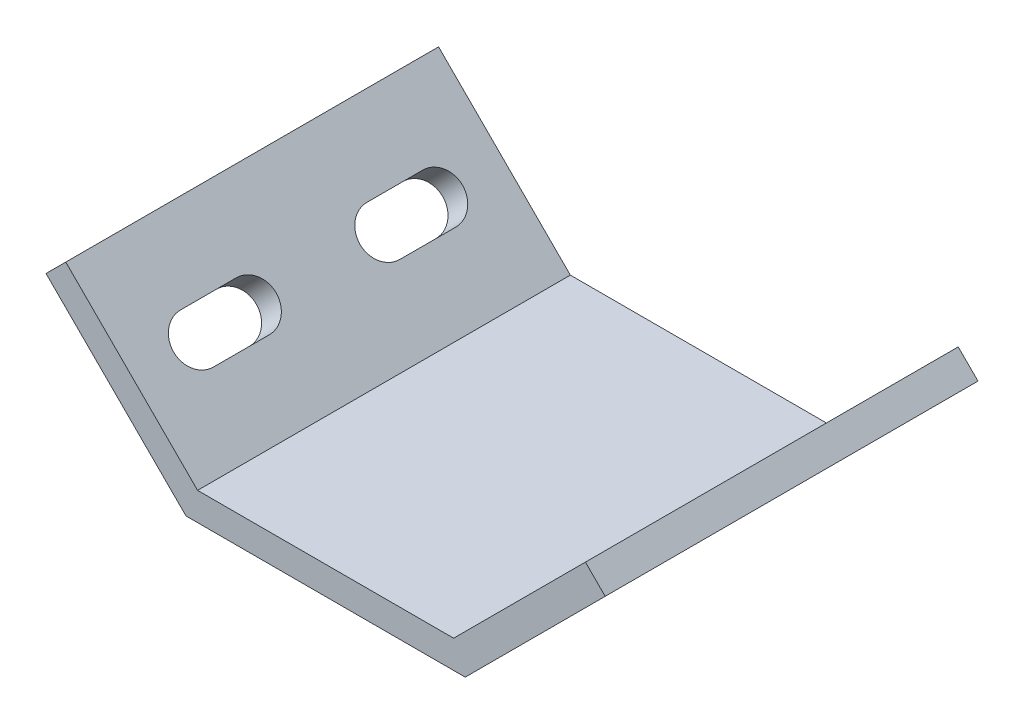
ISO-10303-21;
HEADER;
FILE_DESCRIPTION(('STEP AP214'),'2;1');
FILE_NAME('part.step','',(''),(''),'','','');
FILE_SCHEMA(('AUTOMOTIVE_DESIGN { 1 0 10303 214 1 1 1 1 }'));
ENDSEC;
DATA;
#1=APPLICATION_CONTEXT('core data for automotive mechanical design processes');
#2=APPLICATION_PROTOCOL_DEFINITION('international standard','automotive_design',2000,#1);
#3=PRODUCT_CONTEXT('',#1,'mechanical');
#4=PRODUCT('Part','Part','',(#3));
#5=PRODUCT_RELATED_PRODUCT_CATEGORY('part','',(#4));
#6=PRODUCT_DEFINITION_FORMATION('','',#4);
#7=PRODUCT_DEFINITION_CONTEXT('part definition',#1,'design');
#8=PRODUCT_DEFINITION('design','',#6,#7);
#9=PRODUCT_DEFINITION_SHAPE('','',#8);
#10=(LENGTH_UNIT() NAMED_UNIT(*) SI_UNIT(.MILLI.,.METRE.));
#11=(NAMED_UNIT(*) PLANE_ANGLE_UNIT() SI_UNIT($,.RADIAN.));
#12=(NAMED_UNIT(*) SI_UNIT($,.STERADIAN.) SOLID_ANGLE_UNIT());
#13=UNCERTAINTY_MEASURE_WITH_UNIT(LENGTH_MEASURE(1.E-05),#10,'distance_accuracy_value','');
#14=(GEOMETRIC_REPRESENTATION_CONTEXT(3) GLOBAL_UNCERTAINTY_ASSIGNED_CONTEXT((#13)) GLOBAL_UNIT_ASSIGNED_CONTEXT((#10,
#11,#12)) REPRESENTATION_CONTEXT('',''));
#15=CARTESIAN_POINT('',(0.,0.,0.));
#16=DIRECTION('',(0.,0.,1.));
#17=DIRECTION('',(1.,0.,0.));
#18=AXIS2_PLACEMENT_3D('',#15,#16,#17);
#19=CARTESIAN_POINT('',(15.8578643762691,-2.12132034355965,20.));
#20=DIRECTION('',(-0.707106781186546,0.707106781186549,0.));
#21=DIRECTION('',(-0.707106781186549,-0.707106781186546,0.));
#22=AXIS2_PLACEMENT_3D('',#19,#20,#21);
#23=PLANE('',#22);
#24=DIRECTION('',(0.,0.,-1.));
#25=VECTOR('',#24,1.);
#26=CARTESIAN_POINT('',(14.9791847198287,-3.,20.));
#27=LINE('',#26,#25);
#28=CARTESIAN_POINT('',(14.9791847198287,-3.,20.));
#29=VERTEX_POINT('',#28);
#30=CARTESIAN_POINT('',(14.9791847198287,-3.,-20.));
#31=VERTEX_POINT('',#30);
#32=EDGE_CURVE('E434',#29,#31,#27,.T.);
#33=ORIENTED_EDGE('',*,*,#32,.T.);
#34=DIRECTION('',(0.707106781186549,0.707106781186546,0.));
#35=VECTOR('',#34,1.);
#36=CARTESIAN_POINT('',(15.8578643762691,-2.12132034355965,-20.));
#37=LINE('',#36,#35);
#38=CARTESIAN_POINT('',(30.,12.0208152801712,-20.));
#39=VERTEX_POINT('',#38);
#40=EDGE_CURVE('E284',#31,#39,#37,.T.);
#41=ORIENTED_EDGE('',*,*,#40,.T.);
#42=DIRECTION('',(0.,0.,-1.));
#43=VECTOR('',#42,1.);
#44=CARTESIAN_POINT('',(30.,12.0208152801712,20.));
#45=LINE('',#44,#43);
#46=CARTESIAN_POINT('',(30.,12.0208152801712,20.));
#47=VERTEX_POINT('',#46);
#48=EDGE_CURVE('E454',#47,#39,#45,.T.);
#49=ORIENTED_EDGE('',*,*,#48,.F.);
#50=DIRECTION('',(0.707106781186549,0.707106781186546,0.));
#51=VECTOR('',#50,1.);
#52=CARTESIAN_POINT('',(15.8578643762691,-2.12132034355965,20.));
#53=LINE('',#52,#51);
#54=EDGE_CURVE('E396',#29,#47,#53,.T.);
#55=ORIENTED_EDGE('',*,*,#54,.F.);
#56=EDGE_LOOP('',(#33,#41,#49,#55));
#57=FACE_BOUND('',#56,.T.);
#58=CARTESIAN_POINT('',(22.9289321881345,4.94974746830579,7.));
#59=DIRECTION('',(-0.707106781186546,0.707106781186549,0.));
#60=DIRECTION('',(-0.707106781186549,-0.707106781186546,0.));
#61=AXIS2_PLACEMENT_3D('',#58,#59,#60);
#62=CIRCLE('',#61,2.5);
#63=CARTESIAN_POINT('',(21.1611652351682,3.18198051533942,7.));
#64=VERTEX_POINT('',#63);
#65=CARTESIAN_POINT('',(24.6966991411009,6.71751442127216,7.));
#66=VERTEX_POINT('',#65);
#67=EDGE_CURVE('E374',#64,#66,#62,.F.);
#68=ORIENTED_EDGE('',*,*,#67,.F.);
#69=DIRECTION('',(0.,0.,-1.));
#70=VECTOR('',#69,1.);
#71=CARTESIAN_POINT('',(21.1611652351682,3.18198051533942,20.));
#72=LINE('',#71,#70);
#73=CARTESIAN_POINT('',(21.1611652351682,3.18198051533942,13.));
#74=VERTEX_POINT('',#73);
#75=EDGE_CURVE('E358',#74,#64,#72,.T.);
#76=ORIENTED_EDGE('',*,*,#75,.F.);
#77=CARTESIAN_POINT('',(22.9289321881345,4.94974746830579,13.));
#78=DIRECTION('',(-0.707106781186546,0.707106781186549,0.));
#79=DIRECTION('',(-0.707106781186549,-0.707106781186546,0.));
#80=AXIS2_PLACEMENT_3D('',#77,#78,#79);
#81=CIRCLE('',#80,2.5);
#82=CARTESIAN_POINT('',(24.6966991411009,6.71751442127216,13.));
#83=VERTEX_POINT('',#82);
#84=EDGE_CURVE('E368',#83,#74,#81,.F.);
#85=ORIENTED_EDGE('',*,*,#84,.F.);
#86=DIRECTION('',(0.,0.,1.));
#87=VECTOR('',#86,1.);
#88=CARTESIAN_POINT('',(24.6966991411009,6.71751442127216,20.));
#89=LINE('',#88,#87);
#90=EDGE_CURVE('E371',#66,#83,#89,.T.);
#91=ORIENTED_EDGE('',*,*,#90,.F.);
#92=EDGE_LOOP('',(#68,#76,#85,#91));
#93=FACE_BOUND('',#92,.T.);
#94=CARTESIAN_POINT('',(22.9289321881345,4.94974746830579,-7.));
#95=DIRECTION('',(0.707106781186546,-0.707106781186549,0.));
#96=DIRECTION('',(-0.707106781186549,-0.707106781186546,0.));
#97=AXIS2_PLACEMENT_3D('',#94,#95,#96);
#98=CIRCLE('',#97,2.5);
#99=CARTESIAN_POINT('',(21.1611652351682,3.18198051533942,-7.));
#100=VERTEX_POINT('',#99);
#101=CARTESIAN_POINT('',(24.6966991411009,6.71751442127216,-7.));
#102=VERTEX_POINT('',#101);
#103=EDGE_CURVE('E260',#100,#102,#98,.F.);
#104=ORIENTED_EDGE('',*,*,#103,.T.);
#105=DIRECTION('',(0.,0.,-1.));
#106=VECTOR('',#105,1.);
#107=CARTESIAN_POINT('',(24.6966991411009,6.71751442127216,-20.));
#108=LINE('',#107,#106);
#109=CARTESIAN_POINT('',(24.6966991411009,6.71751442127216,-13.));
#110=VERTEX_POINT('',#109);
#111=EDGE_CURVE('E256',#102,#110,#108,.T.);
#112=ORIENTED_EDGE('',*,*,#111,.T.);
#113=CARTESIAN_POINT('',(22.9289321881345,4.94974746830579,-13.));
#114=DIRECTION('',(0.707106781186546,-0.707106781186549,0.));
#115=DIRECTION('',(-0.707106781186549,-0.707106781186546,0.));
#116=AXIS2_PLACEMENT_3D('',#113,#114,#115);
#117=CIRCLE('',#116,2.5);
#118=CARTESIAN_POINT('',(21.1611652351682,3.18198051533942,-13.));
#119=VERTEX_POINT('',#118);
#120=EDGE_CURVE('E253',#110,#119,#117,.F.);
#121=ORIENTED_EDGE('',*,*,#120,.T.);
#122=DIRECTION('',(0.,0.,1.));
#123=VECTOR('',#122,1.);
#124=CARTESIAN_POINT('',(21.1611652351682,3.18198051533942,-20.));
#125=LINE('',#124,#123);
#126=EDGE_CURVE('E214',#119,#100,#125,.T.);
#127=ORIENTED_EDGE('',*,*,#126,.T.);
#128=EDGE_LOOP('',(#104,#112,#121,#127));
#129=FACE_BOUND('',#128,.T.);
#130=ADVANCED_FACE('F46',(#57,#93,#129),#23,.F.);
#131=CARTESIAN_POINT('',(13.7365440327094,0.,20.));
#132=DIRECTION('',(-0.707106781186546,0.707106781186549,0.));
#133=DIRECTION('',(-0.707106781186549,-0.707106781186546,0.));
#134=AXIS2_PLACEMENT_3D('',#131,#132,#133);
#135=PLANE('',#134);
#136=DIRECTION('',(0.,0.,-1.));
#137=VECTOR('',#136,1.);
#138=CARTESIAN_POINT('',(27.8786796564404,14.1421356237309,20.));
#139=LINE('',#138,#137);
#140=CARTESIAN_POINT('',(27.8786796564404,14.1421356237309,20.));
#141=VERTEX_POINT('',#140);
#142=CARTESIAN_POINT('',(27.8786796564404,14.1421356237309,-20.));
#143=VERTEX_POINT('',#142);
#144=EDGE_CURVE('E452',#141,#143,#139,.T.);
#145=ORIENTED_EDGE('',*,*,#144,.T.);
#146=DIRECTION('',(0.707106781186549,0.707106781186546,0.));
#147=VECTOR('',#146,1.);
#148=CARTESIAN_POINT('',(13.7365440327094,0.,-20.));
#149=LINE('',#148,#147);
#150=CARTESIAN_POINT('',(13.7365440327094,0.,-20.));
#151=VERTEX_POINT('',#150);
#152=EDGE_CURVE('E300',#151,#143,#149,.T.);
#153=ORIENTED_EDGE('',*,*,#152,.F.);
#154=DIRECTION('',(0.,0.,-1.));
#155=VECTOR('',#154,1.);
#156=CARTESIAN_POINT('',(13.7365440327094,0.,20.));
#157=LINE('',#156,#155);
#158=CARTESIAN_POINT('',(13.7365440327094,0.,20.));
#159=VERTEX_POINT('',#158);
#160=EDGE_CURVE('E449',#159,#151,#157,.T.);
#161=ORIENTED_EDGE('',*,*,#160,.F.);
#162=DIRECTION('',(0.707106781186549,0.707106781186546,0.));
#163=VECTOR('',#162,1.);
#164=CARTESIAN_POINT('',(13.7365440327094,0.,20.));
#165=LINE('',#164,#163);
#166=EDGE_CURVE('E412',#159,#141,#165,.T.);
#167=ORIENTED_EDGE('',*,*,#166,.T.);
#168=EDGE_LOOP('',(#145,#153,#161,#167));
#169=FACE_BOUND('',#168,.T.);
#170=DIRECTION('',(0.,0.,-1.));
#171=VECTOR('',#170,1.);
#172=CARTESIAN_POINT('',(19.0398448916085,5.30330085889907,7.));
#173=LINE('',#172,#171);
#174=CARTESIAN_POINT('',(19.0398448916085,5.30330085889907,13.));
#175=VERTEX_POINT('',#174);
#176=CARTESIAN_POINT('',(19.0398448916085,5.30330085889906,7.));
#177=VERTEX_POINT('',#176);
#178=EDGE_CURVE('E342',#175,#177,#173,.T.);
#179=ORIENTED_EDGE('',*,*,#178,.T.);
#180=CARTESIAN_POINT('',(20.8076118445749,7.07106781186544,7.));
#181=DIRECTION('',(0.707106781186546,-0.707106781186549,0.));
#182=DIRECTION('',(0.707106781186549,0.707106781186546,0.));
#183=AXIS2_PLACEMENT_3D('',#180,#181,#182);
#184=CIRCLE('',#183,2.5);
#185=CARTESIAN_POINT('',(22.5753787975413,8.8388347648318,7.));
#186=VERTEX_POINT('',#185);
#187=EDGE_CURVE('E69',#177,#186,#184,.T.);
#188=ORIENTED_EDGE('',*,*,#187,.T.);
#189=DIRECTION('',(0.,0.,1.));
#190=VECTOR('',#189,1.);
#191=CARTESIAN_POINT('',(22.5753787975413,8.8388347648318,7.));
#192=LINE('',#191,#190);
#193=CARTESIAN_POINT('',(22.5753787975413,8.83883476483181,13.));
#194=VERTEX_POINT('',#193);
#195=EDGE_CURVE('E350',#186,#194,#192,.T.);
#196=ORIENTED_EDGE('',*,*,#195,.T.);
#197=CARTESIAN_POINT('',(20.8076118445749,7.07106781186544,13.));
#198=DIRECTION('',(0.707106781186546,-0.707106781186549,0.));
#199=DIRECTION('',(0.707106781186549,0.707106781186546,0.));
#200=AXIS2_PLACEMENT_3D('',#197,#198,#199);
#201=CIRCLE('',#200,2.5);
#202=EDGE_CURVE('E346',#194,#175,#201,.T.);
#203=ORIENTED_EDGE('',*,*,#202,.T.);
#204=EDGE_LOOP('',(#179,#188,#196,#203));
#205=FACE_BOUND('',#204,.T.);
#206=DIRECTION('',(0.,0.,1.));
#207=VECTOR('',#206,1.);
#208=CARTESIAN_POINT('',(19.0398448916085,5.30330085889907,-7.));
#209=LINE('',#208,#207);
#210=CARTESIAN_POINT('',(19.0398448916085,5.30330085889907,-13.));
#211=VERTEX_POINT('',#210);
#212=CARTESIAN_POINT('',(19.0398448916085,5.30330085889906,-7.));
#213=VERTEX_POINT('',#212);
#214=EDGE_CURVE('E212',#211,#213,#209,.T.);
#215=ORIENTED_EDGE('',*,*,#214,.F.);
#216=CARTESIAN_POINT('',(20.8076118445749,7.07106781186544,-13.));
#217=DIRECTION('',(-0.707106781186546,0.707106781186549,0.));
#218=DIRECTION('',(0.707106781186549,0.707106781186546,0.));
#219=AXIS2_PLACEMENT_3D('',#216,#217,#218);
#220=CIRCLE('',#219,2.5);
#221=CARTESIAN_POINT('',(22.5753787975413,8.83883476483181,-13.));
#222=VERTEX_POINT('',#221);
#223=EDGE_CURVE('E223',#222,#211,#220,.T.);
#224=ORIENTED_EDGE('',*,*,#223,.F.);
#225=DIRECTION('',(0.,0.,-1.));
#226=VECTOR('',#225,1.);
#227=CARTESIAN_POINT('',(22.5753787975413,8.8388347648318,-7.));
#228=LINE('',#227,#226);
#229=CARTESIAN_POINT('',(22.5753787975413,8.8388347648318,-7.));
#230=VERTEX_POINT('',#229);
#231=EDGE_CURVE('E229',#230,#222,#228,.T.);
#232=ORIENTED_EDGE('',*,*,#231,.F.);
#233=CARTESIAN_POINT('',(20.8076118445749,7.07106781186544,-7.));
#234=DIRECTION('',(-0.707106781186546,0.707106781186549,0.));
#235=DIRECTION('',(0.707106781186549,0.707106781186546,0.));
#236=AXIS2_PLACEMENT_3D('',#233,#234,#235);
#237=CIRCLE('',#236,2.5);
#238=EDGE_CURVE('E234',#213,#230,#237,.T.);
#239=ORIENTED_EDGE('',*,*,#238,.F.);
#240=EDGE_LOOP('',(#215,#224,#232,#239));
#241=FACE_BOUND('',#240,.T.);
#242=ADVANCED_FACE('F232',(#169,#205,#241),#135,.T.);
#243=CARTESIAN_POINT('',(27.8786796564404,14.1421356237309,20.));
#244=DIRECTION('',(0.707106781186549,0.707106781186546,0.));
#245=DIRECTION('',(-0.707106781186546,0.707106781186549,0.));
#246=AXIS2_PLACEMENT_3D('',#243,#244,#245);
#247=PLANE('',#246);
#248=ORIENTED_EDGE('',*,*,#48,.T.);
#249=DIRECTION('',(0.707106781186546,-0.707106781186549,0.));
#250=VECTOR('',#249,1.);
#251=CARTESIAN_POINT('',(27.8786796564404,14.1421356237309,-20.));
#252=LINE('',#251,#250);
#253=EDGE_CURVE('E296',#143,#39,#252,.T.);
#254=ORIENTED_EDGE('',*,*,#253,.F.);
#255=ORIENTED_EDGE('',*,*,#144,.F.);
#256=DIRECTION('',(0.707106781186546,-0.707106781186549,0.));
#257=VECTOR('',#256,1.);
#258=CARTESIAN_POINT('',(27.8786796564404,14.1421356237309,20.));
#259=LINE('',#258,#257);
#260=EDGE_CURVE('E408',#141,#47,#259,.T.);
#261=ORIENTED_EDGE('',*,*,#260,.T.);
#262=EDGE_LOOP('',(#248,#254,#255,#261));
#263=FACE_BOUND('',#262,.T.);
#264=ADVANCED_FACE('F505',(#263),#247,.T.);
#265=CARTESIAN_POINT('',(-13.7365440327094,0.,20.));
#266=DIRECTION('',(0.,1.,0.));
#267=DIRECTION('',(-1.,0.,0.));
#268=AXIS2_PLACEMENT_3D('',#265,#266,#267);
#269=PLANE('',#268);
#270=ORIENTED_EDGE('',*,*,#160,.T.);
#271=DIRECTION('',(1.,0.,0.));
#272=VECTOR('',#271,1.);
#273=CARTESIAN_POINT('',(-13.7365440327094,0.,-20.));
#274=LINE('',#273,#272);
#275=CARTESIAN_POINT('',(-13.7365440327094,0.,-20.));
#276=VERTEX_POINT('',#275);
#277=EDGE_CURVE('E304',#276,#151,#274,.T.);
#278=ORIENTED_EDGE('',*,*,#277,.F.);
#279=DIRECTION('',(0.,0.,-1.));
#280=VECTOR('',#279,1.);
#281=CARTESIAN_POINT('',(-13.7365440327094,0.,20.));
#282=LINE('',#281,#280);
#283=CARTESIAN_POINT('',(-13.7365440327094,0.,20.));
#284=VERTEX_POINT('',#283);
#285=EDGE_CURVE('E446',#284,#276,#282,.T.);
#286=ORIENTED_EDGE('',*,*,#285,.F.);
#287=DIRECTION('',(1.,0.,0.));
#288=VECTOR('',#287,1.);
#289=CARTESIAN_POINT('',(-13.7365440327094,0.,20.));
#290=LINE('',#289,#288);
#291=EDGE_CURVE('E416',#284,#159,#290,.T.);
#292=ORIENTED_EDGE('',*,*,#291,.T.);
#293=EDGE_LOOP('',(#270,#278,#286,#292));
#294=FACE_BOUND('',#293,.T.);
#295=ADVANCED_FACE('F585',(#294),#269,.T.);
#296=CARTESIAN_POINT('',(-13.7365440327094,0.,20.));
#297=DIRECTION('',(0.707106781186546,0.707106781186549,0.));
#298=DIRECTION('',(-0.707106781186549,0.707106781186546,0.));
#299=AXIS2_PLACEMENT_3D('',#296,#297,#298);
#300=PLANE('',#299);
#301=CARTESIAN_POINT('',(-20.8076118445749,7.07106781186544,7.));
#302=DIRECTION('',(0.707106781186546,0.707106781186549,0.));
#303=DIRECTION('',(-0.707106781186549,0.707106781186546,0.));
#304=AXIS2_PLACEMENT_3D('',#301,#302,#303);
#305=CIRCLE('',#304,2.5);
#306=CARTESIAN_POINT('',(-19.0398448916085,5.30330085889907,7.));
#307=VERTEX_POINT('',#306);
#308=CARTESIAN_POINT('',(-22.5753787975413,8.8388347648318,7.));
#309=VERTEX_POINT('',#308);
#310=EDGE_CURVE('E377',#307,#309,#305,.T.);
#311=ORIENTED_EDGE('',*,*,#310,.F.);
#312=DIRECTION('',(0.,0.,-1.));
#313=VECTOR('',#312,1.);
#314=CARTESIAN_POINT('',(-19.0398448916085,5.30330085889907,7.));
#315=LINE('',#314,#313);
#316=CARTESIAN_POINT('',(-19.0398448916085,5.30330085889907,13.));
#317=VERTEX_POINT('',#316);
#318=EDGE_CURVE('E388',#317,#307,#315,.T.);
#319=ORIENTED_EDGE('',*,*,#318,.F.);
#320=CARTESIAN_POINT('',(-20.8076118445749,7.07106781186544,13.));
#321=DIRECTION('',(0.707106781186546,0.707106781186549,0.));
#322=DIRECTION('',(-0.707106781186549,0.707106781186546,0.));
#323=AXIS2_PLACEMENT_3D('',#320,#321,#322);
#324=CIRCLE('',#323,2.5);
#325=CARTESIAN_POINT('',(-22.5753787975413,8.83883476483181,13.));
#326=VERTEX_POINT('',#325);
#327=EDGE_CURVE('E384',#326,#317,#324,.T.);
#328=ORIENTED_EDGE('',*,*,#327,.F.);
#329=DIRECTION('',(0.,0.,1.));
#330=VECTOR('',#329,1.);
#331=CARTESIAN_POINT('',(-22.5753787975413,8.8388347648318,7.));
#332=LINE('',#331,#330);
#333=EDGE_CURVE('E380',#309,#326,#332,.T.);
#334=ORIENTED_EDGE('',*,*,#333,.F.);
#335=EDGE_LOOP('',(#311,#319,#328,#334));
#336=FACE_BOUND('',#335,.T.);
#337=ORIENTED_EDGE('',*,*,#285,.T.);
#338=DIRECTION('',(0.707106781186549,-0.707106781186546,0.));
#339=VECTOR('',#338,1.);
#340=CARTESIAN_POINT('',(-13.7365440327094,0.,-20.));
#341=LINE('',#340,#339);
#342=CARTESIAN_POINT('',(-27.8786796564404,14.1421356237309,-20.));
#343=VERTEX_POINT('',#342);
#344=EDGE_CURVE('E308',#343,#276,#341,.T.);
#345=ORIENTED_EDGE('',*,*,#344,.F.);
#346=DIRECTION('',(0.,0.,-1.));
#347=VECTOR('',#346,1.);
#348=CARTESIAN_POINT('',(-27.8786796564404,14.1421356237309,20.));
#349=LINE('',#348,#347);
#350=CARTESIAN_POINT('',(-27.8786796564404,14.1421356237309,20.));
#351=VERTEX_POINT('',#350);
#352=EDGE_CURVE('E443',#351,#343,#349,.T.);
#353=ORIENTED_EDGE('',*,*,#352,.F.);
#354=DIRECTION('',(0.707106781186549,-0.707106781186546,0.));
#355=VECTOR('',#354,1.);
#356=CARTESIAN_POINT('',(-13.7365440327094,0.,20.));
#357=LINE('',#356,#355);
#358=EDGE_CURVE('E420',#351,#284,#357,.T.);
#359=ORIENTED_EDGE('',*,*,#358,.T.);
#360=EDGE_LOOP('',(#337,#345,#353,#359));
#361=FACE_BOUND('',#360,.T.);
#362=CARTESIAN_POINT('',(-20.8076118445749,7.07106781186544,-7.));
#363=DIRECTION('',(-0.707106781186546,-0.707106781186549,0.));
#364=DIRECTION('',(-0.707106781186549,0.707106781186546,0.));
#365=AXIS2_PLACEMENT_3D('',#362,#363,#364);
#366=CIRCLE('',#365,2.5);
#367=CARTESIAN_POINT('',(-19.0398448916085,5.30330085889907,-7.));
#368=VERTEX_POINT('',#367);
#369=CARTESIAN_POINT('',(-22.5753787975413,8.8388347648318,-7.));
#370=VERTEX_POINT('',#369);
#371=EDGE_CURVE('E264',#368,#370,#366,.T.);
#372=ORIENTED_EDGE('',*,*,#371,.T.);
#373=DIRECTION('',(0.,0.,-1.));
#374=VECTOR('',#373,1.);
#375=CARTESIAN_POINT('',(-22.5753787975413,8.8388347648318,-7.));
#376=LINE('',#375,#374);
#377=CARTESIAN_POINT('',(-22.5753787975413,8.83883476483181,-13.));
#378=VERTEX_POINT('',#377);
#379=EDGE_CURVE('E268',#370,#378,#376,.T.);
#380=ORIENTED_EDGE('',*,*,#379,.T.);
#381=CARTESIAN_POINT('',(-20.8076118445749,7.07106781186544,-13.));
#382=DIRECTION('',(-0.707106781186546,-0.707106781186549,0.));
#383=DIRECTION('',(-0.707106781186549,0.707106781186546,0.));
#384=AXIS2_PLACEMENT_3D('',#381,#382,#383);
#385=CIRCLE('',#384,2.5);
#386=CARTESIAN_POINT('',(-19.0398448916085,5.30330085889907,-13.));
#387=VERTEX_POINT('',#386);
#388=EDGE_CURVE('E272',#378,#387,#385,.T.);
#389=ORIENTED_EDGE('',*,*,#388,.T.);
#390=DIRECTION('',(0.,0.,1.));
#391=VECTOR('',#390,1.);
#392=CARTESIAN_POINT('',(-19.0398448916085,5.30330085889907,-7.));
#393=LINE('',#392,#391);
#394=EDGE_CURVE('E276',#387,#368,#393,.T.);
#395=ORIENTED_EDGE('',*,*,#394,.T.);
#396=EDGE_LOOP('',(#372,#380,#389,#395));
#397=FACE_BOUND('',#396,.T.);
#398=ADVANCED_FACE('F482',(#336,#361,#397),#300,.T.);
#399=CARTESIAN_POINT('',(-30.,12.0208152801712,20.));
#400=DIRECTION('',(-0.707106781186549,0.707106781186546,0.));
#401=DIRECTION('',(-0.707106781186546,-0.707106781186549,0.));
#402=AXIS2_PLACEMENT_3D('',#399,#400,#401);
#403=PLANE('',#402);
#404=ORIENTED_EDGE('',*,*,#352,.T.);
#405=DIRECTION('',(0.707106781186546,0.707106781186549,0.));
#406=VECTOR('',#405,1.);
#407=CARTESIAN_POINT('',(-30.,12.0208152801712,-20.));
#408=LINE('',#407,#406);
#409=CARTESIAN_POINT('',(-30.,12.0208152801712,-20.));
#410=VERTEX_POINT('',#409);
#411=EDGE_CURVE('E312',#410,#343,#408,.T.);
#412=ORIENTED_EDGE('',*,*,#411,.F.);
#413=DIRECTION('',(0.,0.,-1.));
#414=VECTOR('',#413,1.);
#415=CARTESIAN_POINT('',(-30.,12.0208152801712,20.));
#416=LINE('',#415,#414);
#417=CARTESIAN_POINT('',(-30.,12.0208152801712,20.));
#418=VERTEX_POINT('',#417);
#419=EDGE_CURVE('E440',#418,#410,#416,.T.);
#420=ORIENTED_EDGE('',*,*,#419,.F.);
#421=DIRECTION('',(0.707106781186546,0.707106781186549,0.));
#422=VECTOR('',#421,1.);
#423=CARTESIAN_POINT('',(-30.,12.0208152801712,20.));
#424=LINE('',#423,#422);
#425=EDGE_CURVE('E424',#418,#351,#424,.T.);
#426=ORIENTED_EDGE('',*,*,#425,.T.);
#427=EDGE_LOOP('',(#404,#412,#420,#426));
#428=FACE_BOUND('',#427,.T.);
#429=ADVANCED_FACE('F579',(#428),#403,.T.);
#430=CARTESIAN_POINT('',(-15.8578643762691,-2.12132034355965,20.));
#431=DIRECTION('',(0.707106781186546,0.707106781186549,0.));
#432=DIRECTION('',(-0.707106781186549,0.707106781186546,0.));
#433=AXIS2_PLACEMENT_3D('',#430,#431,#432);
#434=PLANE('',#433);
#435=DIRECTION('',(0.,0.,-1.));
#436=VECTOR('',#435,1.);
#437=CARTESIAN_POINT('',(-21.1611652351682,3.18198051533942,20.));
#438=LINE('',#437,#436);
#439=CARTESIAN_POINT('',(-21.1611652351682,3.18198051533942,13.));
#440=VERTEX_POINT('',#439);
#441=CARTESIAN_POINT('',(-21.1611652351682,3.18198051533942,7.));
#442=VERTEX_POINT('',#441);
#443=EDGE_CURVE('E54',#440,#442,#438,.T.);
#444=ORIENTED_EDGE('',*,*,#443,.T.);
#445=CARTESIAN_POINT('',(-22.9289321881345,4.94974746830579,7.));
#446=DIRECTION('',(0.707106781186546,0.707106781186549,0.));
#447=DIRECTION('',(-0.707106781186549,0.707106781186546,0.));
#448=AXIS2_PLACEMENT_3D('',#445,#446,#447);
#449=CIRCLE('',#448,2.5);
#450=CARTESIAN_POINT('',(-24.6966991411009,6.71751442127216,7.));
#451=VERTEX_POINT('',#450);
#452=EDGE_CURVE('E11',#442,#451,#449,.T.);
#453=ORIENTED_EDGE('',*,*,#452,.T.);
#454=DIRECTION('',(0.,0.,1.));
#455=VECTOR('',#454,1.);
#456=CARTESIAN_POINT('',(-24.6966991411009,6.71751442127216,20.));
#457=LINE('',#456,#455);
#458=CARTESIAN_POINT('',(-24.6966991411009,6.71751442127216,13.));
#459=VERTEX_POINT('',#458);
#460=EDGE_CURVE('E457',#451,#459,#457,.T.);
#461=ORIENTED_EDGE('',*,*,#460,.T.);
#462=CARTESIAN_POINT('',(-22.9289321881345,4.94974746830579,13.));
#463=DIRECTION('',(0.707106781186546,0.707106781186549,0.));
#464=DIRECTION('',(-0.707106781186549,0.707106781186546,0.));
#465=AXIS2_PLACEMENT_3D('',#462,#463,#464);
#466=CIRCLE('',#465,2.5);
#467=EDGE_CURVE('E461',#459,#440,#466,.T.);
#468=ORIENTED_EDGE('',*,*,#467,.T.);
#469=EDGE_LOOP('',(#444,#453,#461,#468));
#470=FACE_BOUND('',#469,.T.);
#471=ORIENTED_EDGE('',*,*,#419,.T.);
#472=DIRECTION('',(0.707106781186549,-0.707106781186546,0.));
#473=VECTOR('',#472,1.);
#474=CARTESIAN_POINT('',(-15.8578643762691,-2.12132034355965,-20.));
#475=LINE('',#474,#473);
#476=CARTESIAN_POINT('',(-14.9791847198287,-3.,-20.));
#477=VERTEX_POINT('',#476);
#478=EDGE_CURVE('E316',#410,#477,#475,.T.);
#479=ORIENTED_EDGE('',*,*,#478,.T.);
#480=DIRECTION('',(0.,0.,-1.));
#481=VECTOR('',#480,1.);
#482=CARTESIAN_POINT('',(-14.9791847198287,-3.,20.));
#483=LINE('',#482,#481);
#484=CARTESIAN_POINT('',(-14.9791847198287,-3.,20.));
#485=VERTEX_POINT('',#484);
#486=EDGE_CURVE('E437',#485,#477,#483,.T.);
#487=ORIENTED_EDGE('',*,*,#486,.F.);
#488=DIRECTION('',(0.707106781186549,-0.707106781186546,0.));
#489=VECTOR('',#488,1.);
#490=CARTESIAN_POINT('',(-15.8578643762691,-2.12132034355965,20.));
#491=LINE('',#490,#489);
#492=EDGE_CURVE('E428',#418,#485,#491,.T.);
#493=ORIENTED_EDGE('',*,*,#492,.F.);
#494=EDGE_LOOP('',(#471,#479,#487,#493));
#495=FACE_BOUND('',#494,.T.);
#496=DIRECTION('',(0.,0.,1.));
#497=VECTOR('',#496,1.);
#498=CARTESIAN_POINT('',(-21.1611652351682,3.18198051533942,-20.));
#499=LINE('',#498,#497);
#500=CARTESIAN_POINT('',(-21.1611652351682,3.18198051533942,-13.));
#501=VERTEX_POINT('',#500);
#502=CARTESIAN_POINT('',(-21.1611652351682,3.18198051533942,-7.));
#503=VERTEX_POINT('',#502);
#504=EDGE_CURVE('E332',#501,#503,#499,.T.);
#505=ORIENTED_EDGE('',*,*,#504,.F.);
#506=CARTESIAN_POINT('',(-22.9289321881345,4.94974746830579,-13.));
#507=DIRECTION('',(-0.707106781186546,-0.707106781186549,0.));
#508=DIRECTION('',(-0.707106781186549,0.707106781186546,0.));
#509=AXIS2_PLACEMENT_3D('',#506,#507,#508);
#510=CIRCLE('',#509,2.5);
#511=CARTESIAN_POINT('',(-24.6966991411009,6.71751442127216,-13.));
#512=VERTEX_POINT('',#511);
#513=EDGE_CURVE('E328',#512,#501,#510,.T.);
#514=ORIENTED_EDGE('',*,*,#513,.F.);
#515=DIRECTION('',(0.,0.,-1.));
#516=VECTOR('',#515,1.);
#517=CARTESIAN_POINT('',(-24.6966991411009,6.71751442127216,-20.));
#518=LINE('',#517,#516);
#519=CARTESIAN_POINT('',(-24.6966991411009,6.71751442127216,-7.));
#520=VERTEX_POINT('',#519);
#521=EDGE_CURVE('E324',#520,#512,#518,.T.);
#522=ORIENTED_EDGE('',*,*,#521,.F.);
#523=CARTESIAN_POINT('',(-22.9289321881345,4.94974746830579,-7.));
#524=DIRECTION('',(-0.707106781186546,-0.707106781186549,0.));
#525=DIRECTION('',(-0.707106781186549,0.707106781186546,0.));
#526=AXIS2_PLACEMENT_3D('',#523,#524,#525);
#527=CIRCLE('',#526,2.5);
#528=EDGE_CURVE('E336',#503,#520,#527,.T.);
#529=ORIENTED_EDGE('',*,*,#528,.F.);
#530=EDGE_LOOP('',(#505,#514,#522,#529));
#531=FACE_BOUND('',#530,.T.);
#532=ADVANCED_FACE('F468',(#470,#495,#531),#434,.F.);
#533=CARTESIAN_POINT('',(-13.7365440327094,-3.,20.));
#534=DIRECTION('',(0.,1.,0.));
#535=DIRECTION('',(-1.,0.,0.));
#536=AXIS2_PLACEMENT_3D('',#533,#534,#535);
#537=PLANE('',#536);
#538=ORIENTED_EDGE('',*,*,#486,.T.);
#539=DIRECTION('',(1.,0.,0.));
#540=VECTOR('',#539,1.);
#541=CARTESIAN_POINT('',(-13.7365440327094,-3.,-20.));
#542=LINE('',#541,#540);
#543=EDGE_CURVE('E320',#477,#31,#542,.T.);
#544=ORIENTED_EDGE('',*,*,#543,.T.);
#545=ORIENTED_EDGE('',*,*,#32,.F.);
#546=DIRECTION('',(1.,0.,0.));
#547=VECTOR('',#546,1.);
#548=CARTESIAN_POINT('',(-13.7365440327094,-3.,20.));
#549=LINE('',#548,#547);
#550=EDGE_CURVE('E431',#485,#29,#549,.T.);
#551=ORIENTED_EDGE('',*,*,#550,.F.);
#552=EDGE_LOOP('',(#538,#544,#545,#551));
#553=FACE_BOUND('',#552,.T.);
#554=ADVANCED_FACE('F570',(#553),#537,.F.);
#555=CARTESIAN_POINT('',(0.,0.,20.));
#556=DIRECTION('',(0.,0.,-1.));
#557=DIRECTION('',(-1.,0.,0.));
#558=AXIS2_PLACEMENT_3D('',#555,#556,#557);
#559=PLANE('',#558);
#560=ORIENTED_EDGE('',*,*,#54,.T.);
#561=ORIENTED_EDGE('',*,*,#260,.F.);
#562=ORIENTED_EDGE('',*,*,#166,.F.);
#563=ORIENTED_EDGE('',*,*,#291,.F.);
#564=ORIENTED_EDGE('',*,*,#358,.F.);
#565=ORIENTED_EDGE('',*,*,#425,.F.);
#566=ORIENTED_EDGE('',*,*,#492,.T.);
#567=ORIENTED_EDGE('',*,*,#550,.T.);
#568=EDGE_LOOP('',(#560,#561,#562,#563,#564,#565,#566,#567));
#569=FACE_BOUND('',#568,.T.);
#570=ADVANCED_FACE('F566',(#569),#559,.F.);
#571=CARTESIAN_POINT('',(-30.4393398282201,-2.56066017177985,7.));
#572=DIRECTION('',(0.707106781186546,0.707106781186549,0.));
#573=DIRECTION('',(-0.707106781186549,0.707106781186546,0.));
#574=AXIS2_PLACEMENT_3D('',#571,#572,#573);
#575=CYLINDRICAL_SURFACE('',#574,2.5);
#576=DIRECTION('',(0.707106781186546,0.707106781186549,0.));
#577=VECTOR('',#576,1.);
#578=CARTESIAN_POINT('',(-28.6715728752538,-4.32842712474622,7.));
#579=LINE('',#578,#577);
#580=EDGE_CURVE('E393',#442,#307,#579,.T.);
#581=ORIENTED_EDGE('',*,*,#580,.T.);
#582=ORIENTED_EDGE('',*,*,#310,.T.);
#583=DIRECTION('',(0.707106781186546,0.707106781186549,0.));
#584=VECTOR('',#583,1.);
#585=CARTESIAN_POINT('',(-32.2071067811865,-0.792893218813486,7.));
#586=LINE('',#585,#584);
#587=EDGE_CURVE('E392',#451,#309,#586,.T.);
#588=ORIENTED_EDGE('',*,*,#587,.F.);
#589=ORIENTED_EDGE('',*,*,#452,.F.);
#590=EDGE_LOOP('',(#581,#582,#588,#589));
#591=FACE_BOUND('',#590,.T.);
#592=ADVANCED_FACE('F486',(#591),#575,.F.);
#593=CARTESIAN_POINT('',(-28.6715728752538,-4.32842712474622,7.));
#594=DIRECTION('',(0.707106781186549,-0.707106781186546,0.));
#595=DIRECTION('',(0.707106781186546,0.707106781186549,0.));
#596=AXIS2_PLACEMENT_3D('',#593,#594,#595);
#597=PLANE('',#596);
#598=DIRECTION('',(0.707106781186546,0.707106781186549,0.));
#599=VECTOR('',#598,1.);
#600=CARTESIAN_POINT('',(-28.6715728752538,-4.32842712474622,13.));
#601=LINE('',#600,#599);
#602=EDGE_CURVE('E397',#440,#317,#601,.T.);
#603=ORIENTED_EDGE('',*,*,#602,.T.);
#604=ORIENTED_EDGE('',*,*,#318,.T.);
#605=ORIENTED_EDGE('',*,*,#580,.F.);
#606=ORIENTED_EDGE('',*,*,#443,.F.);
#607=EDGE_LOOP('',(#603,#604,#605,#606));
#608=FACE_BOUND('',#607,.T.);
#609=ADVANCED_FACE('F474',(#608),#597,.F.);
#610=CARTESIAN_POINT('',(-30.4393398282201,-2.56066017177985,13.));
#611=DIRECTION('',(0.707106781186546,0.707106781186549,0.));
#612=DIRECTION('',(-0.707106781186549,0.707106781186546,0.));
#613=AXIS2_PLACEMENT_3D('',#610,#611,#612);
#614=CYLINDRICAL_SURFACE('',#613,2.5);
#615=DIRECTION('',(0.707106781186546,0.707106781186549,0.));
#616=VECTOR('',#615,1.);
#617=CARTESIAN_POINT('',(-32.2071067811865,-0.792893218813481,13.));
#618=LINE('',#617,#616);
#619=EDGE_CURVE('E400',#459,#326,#618,.T.);
#620=ORIENTED_EDGE('',*,*,#619,.T.);
#621=ORIENTED_EDGE('',*,*,#327,.T.);
#622=ORIENTED_EDGE('',*,*,#602,.F.);
#623=ORIENTED_EDGE('',*,*,#467,.F.);
#624=EDGE_LOOP('',(#620,#621,#622,#623));
#625=FACE_BOUND('',#624,.T.);
#626=ADVANCED_FACE('F476',(#625),#614,.F.);
#627=CARTESIAN_POINT('',(-32.2071067811865,-0.792893218813486,7.));
#628=DIRECTION('',(-0.707106781186549,0.707106781186546,0.));
#629=DIRECTION('',(-0.707106781186546,-0.707106781186549,0.));
#630=AXIS2_PLACEMENT_3D('',#627,#628,#629);
#631=PLANE('',#630);
#632=ORIENTED_EDGE('',*,*,#587,.T.);
#633=ORIENTED_EDGE('',*,*,#333,.T.);
#634=ORIENTED_EDGE('',*,*,#619,.F.);
#635=ORIENTED_EDGE('',*,*,#460,.F.);
#636=EDGE_LOOP('',(#632,#633,#634,#635));
#637=FACE_BOUND('',#636,.T.);
#638=ADVANCED_FACE('F488',(#637),#631,.F.);
#639=CARTESIAN_POINT('',(30.4393398282201,-2.56066017177985,7.));
#640=DIRECTION('',(-0.707106781186546,0.707106781186549,0.));
#641=DIRECTION('',(-0.707106781186549,-0.707106781186546,0.));
#642=AXIS2_PLACEMENT_3D('',#639,#640,#641);
#643=CYLINDRICAL_SURFACE('',#642,2.5);
#644=ORIENTED_EDGE('',*,*,#67,.T.);
#645=DIRECTION('',(-0.707106781186546,0.707106781186549,0.));
#646=VECTOR('',#645,1.);
#647=CARTESIAN_POINT('',(32.2071067811865,-0.792893218813486,7.));
#648=LINE('',#647,#646);
#649=EDGE_CURVE('E355',#66,#186,#648,.T.);
#650=ORIENTED_EDGE('',*,*,#649,.T.);
#651=ORIENTED_EDGE('',*,*,#187,.F.);
#652=DIRECTION('',(-0.707106781186546,0.707106781186549,0.));
#653=VECTOR('',#652,1.);
#654=CARTESIAN_POINT('',(28.6715728752538,-4.32842712474622,7.));
#655=LINE('',#654,#653);
#656=EDGE_CURVE('E354',#64,#177,#655,.T.);
#657=ORIENTED_EDGE('',*,*,#656,.F.);
#658=EDGE_LOOP('',(#644,#650,#651,#657));
#659=FACE_BOUND('',#658,.T.);
#660=ADVANCED_FACE('F490',(#659),#643,.F.);
#661=CARTESIAN_POINT('',(32.2071067811865,-0.792893218813486,7.));
#662=DIRECTION('',(-0.707106781186549,-0.707106781186546,0.));
#663=DIRECTION('',(0.707106781186546,-0.707106781186549,0.));
#664=AXIS2_PLACEMENT_3D('',#661,#662,#663);
#665=PLANE('',#664);
#666=ORIENTED_EDGE('',*,*,#90,.T.);
#667=DIRECTION('',(-0.707106781186546,0.707106781186549,0.));
#668=VECTOR('',#667,1.);
#669=CARTESIAN_POINT('',(32.2071067811865,-0.792893218813481,13.));
#670=LINE('',#669,#668);
#671=EDGE_CURVE('E359',#83,#194,#670,.T.);
#672=ORIENTED_EDGE('',*,*,#671,.T.);
#673=ORIENTED_EDGE('',*,*,#195,.F.);
#674=ORIENTED_EDGE('',*,*,#649,.F.);
#675=EDGE_LOOP('',(#666,#672,#673,#674));
#676=FACE_BOUND('',#675,.T.);
#677=ADVANCED_FACE('F496',(#676),#665,.T.);
#678=CARTESIAN_POINT('',(30.4393398282201,-2.56066017177985,13.));
#679=DIRECTION('',(-0.707106781186546,0.707106781186549,0.));
#680=DIRECTION('',(-0.707106781186549,-0.707106781186546,0.));
#681=AXIS2_PLACEMENT_3D('',#678,#679,#680);
#682=CYLINDRICAL_SURFACE('',#681,2.5);
#683=ORIENTED_EDGE('',*,*,#84,.T.);
#684=DIRECTION('',(-0.707106781186546,0.707106781186549,0.));
#685=VECTOR('',#684,1.);
#686=CARTESIAN_POINT('',(28.6715728752538,-4.32842712474622,13.));
#687=LINE('',#686,#685);
#688=EDGE_CURVE('E61',#74,#175,#687,.T.);
#689=ORIENTED_EDGE('',*,*,#688,.T.);
#690=ORIENTED_EDGE('',*,*,#202,.F.);
#691=ORIENTED_EDGE('',*,*,#671,.F.);
#692=EDGE_LOOP('',(#683,#689,#690,#691));
#693=FACE_BOUND('',#692,.T.);
#694=ADVANCED_FACE('F555',(#693),#682,.F.);
#695=CARTESIAN_POINT('',(28.6715728752538,-4.32842712474622,7.));
#696=DIRECTION('',(0.707106781186549,0.707106781186546,0.));
#697=DIRECTION('',(-0.707106781186546,0.707106781186549,0.));
#698=AXIS2_PLACEMENT_3D('',#695,#696,#697);
#699=PLANE('',#698);
#700=ORIENTED_EDGE('',*,*,#75,.T.);
#701=ORIENTED_EDGE('',*,*,#656,.T.);
#702=ORIENTED_EDGE('',*,*,#178,.F.);
#703=ORIENTED_EDGE('',*,*,#688,.F.);
#704=EDGE_LOOP('',(#700,#701,#702,#703));
#705=FACE_BOUND('',#704,.T.);
#706=ADVANCED_FACE('F551',(#705),#699,.T.);
#707=CARTESIAN_POINT('',(0.,0.,-20.));
#708=DIRECTION('',(0.,0.,1.));
#709=DIRECTION('',(-1.,0.,0.));
#710=AXIS2_PLACEMENT_3D('',#707,#708,#709);
#711=PLANE('',#710);
#712=ORIENTED_EDGE('',*,*,#40,.F.);
#713=ORIENTED_EDGE('',*,*,#543,.F.);
#714=ORIENTED_EDGE('',*,*,#478,.F.);
#715=ORIENTED_EDGE('',*,*,#411,.T.);
#716=ORIENTED_EDGE('',*,*,#344,.T.);
#717=ORIENTED_EDGE('',*,*,#277,.T.);
#718=ORIENTED_EDGE('',*,*,#152,.T.);
#719=ORIENTED_EDGE('',*,*,#253,.T.);
#720=EDGE_LOOP('',(#712,#713,#714,#715,#716,#717,#718,#719));
#721=FACE_BOUND('',#720,.T.);
#722=ADVANCED_FACE('F547',(#721),#711,.F.);
#723=CARTESIAN_POINT('',(-30.4393398282201,-2.56066017177985,-7.));
#724=DIRECTION('',(0.707106781186546,0.707106781186549,0.));
#725=DIRECTION('',(-0.707106781186549,0.707106781186546,0.));
#726=AXIS2_PLACEMENT_3D('',#723,#724,#725);
#727=CYLINDRICAL_SURFACE('',#726,2.5);
#728=DIRECTION('',(0.707106781186546,0.707106781186549,0.));
#729=VECTOR('',#728,1.);
#730=CARTESIAN_POINT('',(-28.6715728752538,-4.32842712474622,-7.));
#731=LINE('',#730,#729);
#732=EDGE_CURVE('E281',#503,#368,#731,.T.);
#733=ORIENTED_EDGE('',*,*,#732,.F.);
#734=ORIENTED_EDGE('',*,*,#528,.T.);
#735=DIRECTION('',(0.707106781186546,0.707106781186549,0.));
#736=VECTOR('',#735,1.);
#737=CARTESIAN_POINT('',(-32.2071067811865,-0.792893218813486,-7.));
#738=LINE('',#737,#736);
#739=EDGE_CURVE('E280',#520,#370,#738,.T.);
#740=ORIENTED_EDGE('',*,*,#739,.T.);
#741=ORIENTED_EDGE('',*,*,#371,.F.);
#742=EDGE_LOOP('',(#733,#734,#740,#741));
#743=FACE_BOUND('',#742,.T.);
#744=ADVANCED_FACE('F537',(#743),#727,.F.);
#745=CARTESIAN_POINT('',(-28.6715728752538,-4.32842712474622,-7.));
#746=DIRECTION('',(0.707106781186549,-0.707106781186546,0.));
#747=DIRECTION('',(0.707106781186546,0.707106781186549,0.));
#748=AXIS2_PLACEMENT_3D('',#745,#746,#747);
#749=PLANE('',#748);
#750=DIRECTION('',(0.707106781186546,0.707106781186549,0.));
#751=VECTOR('',#750,1.);
#752=CARTESIAN_POINT('',(-28.6715728752538,-4.32842712474622,-13.));
#753=LINE('',#752,#751);
#754=EDGE_CURVE('E285',#501,#387,#753,.T.);
#755=ORIENTED_EDGE('',*,*,#754,.F.);
#756=ORIENTED_EDGE('',*,*,#504,.T.);
#757=ORIENTED_EDGE('',*,*,#732,.T.);
#758=ORIENTED_EDGE('',*,*,#394,.F.);
#759=EDGE_LOOP('',(#755,#756,#757,#758));
#760=FACE_BOUND('',#759,.T.);
#761=ADVANCED_FACE('F533',(#760),#749,.F.);
#762=CARTESIAN_POINT('',(-30.4393398282201,-2.56066017177985,-13.));
#763=DIRECTION('',(0.707106781186546,0.707106781186549,0.));
#764=DIRECTION('',(-0.707106781186549,0.707106781186546,0.));
#765=AXIS2_PLACEMENT_3D('',#762,#763,#764);
#766=CYLINDRICAL_SURFACE('',#765,2.5);
#767=DIRECTION('',(0.707106781186546,0.707106781186549,0.));
#768=VECTOR('',#767,1.);
#769=CARTESIAN_POINT('',(-32.2071067811865,-0.792893218813481,-13.));
#770=LINE('',#769,#768);
#771=EDGE_CURVE('E288',#512,#378,#770,.T.);
#772=ORIENTED_EDGE('',*,*,#771,.F.);
#773=ORIENTED_EDGE('',*,*,#513,.T.);
#774=ORIENTED_EDGE('',*,*,#754,.T.);
#775=ORIENTED_EDGE('',*,*,#388,.F.);
#776=EDGE_LOOP('',(#772,#773,#774,#775));
#777=FACE_BOUND('',#776,.T.);
#778=ADVANCED_FACE('F536',(#777),#766,.F.);
#779=CARTESIAN_POINT('',(-32.2071067811865,-0.792893218813486,-7.));
#780=DIRECTION('',(-0.707106781186549,0.707106781186546,0.));
#781=DIRECTION('',(-0.707106781186546,-0.707106781186549,0.));
#782=AXIS2_PLACEMENT_3D('',#779,#780,#781);
#783=PLANE('',#782);
#784=ORIENTED_EDGE('',*,*,#739,.F.);
#785=ORIENTED_EDGE('',*,*,#521,.T.);
#786=ORIENTED_EDGE('',*,*,#771,.T.);
#787=ORIENTED_EDGE('',*,*,#379,.F.);
#788=EDGE_LOOP('',(#784,#785,#786,#787));
#789=FACE_BOUND('',#788,.T.);
#790=ADVANCED_FACE('F528',(#789),#783,.F.);
#791=CARTESIAN_POINT('',(30.4393398282201,-2.56066017177985,-7.));
#792=DIRECTION('',(-0.707106781186546,0.707106781186549,0.));
#793=DIRECTION('',(-0.707106781186549,-0.707106781186546,0.));
#794=AXIS2_PLACEMENT_3D('',#791,#792,#793);
#795=CYLINDRICAL_SURFACE('',#794,2.5);
#796=ORIENTED_EDGE('',*,*,#103,.F.);
#797=DIRECTION('',(-0.707106781186546,0.707106781186549,0.));
#798=VECTOR('',#797,1.);
#799=CARTESIAN_POINT('',(28.6715728752538,-4.32842712474622,-7.));
#800=LINE('',#799,#798);
#801=EDGE_CURVE('E220',#100,#213,#800,.T.);
#802=ORIENTED_EDGE('',*,*,#801,.T.);
#803=ORIENTED_EDGE('',*,*,#238,.T.);
#804=DIRECTION('',(-0.707106781186546,0.707106781186549,0.));
#805=VECTOR('',#804,1.);
#806=CARTESIAN_POINT('',(32.2071067811865,-0.792893218813486,-7.));
#807=LINE('',#806,#805);
#808=EDGE_CURVE('E244',#102,#230,#807,.T.);
#809=ORIENTED_EDGE('',*,*,#808,.F.);
#810=EDGE_LOOP('',(#796,#802,#803,#809));
#811=FACE_BOUND('',#810,.T.);
#812=ADVANCED_FACE('F518',(#811),#795,.F.);
#813=CARTESIAN_POINT('',(32.2071067811865,-0.792893218813486,-7.));
#814=DIRECTION('',(-0.707106781186549,-0.707106781186546,0.));
#815=DIRECTION('',(0.707106781186546,-0.707106781186549,0.));
#816=AXIS2_PLACEMENT_3D('',#813,#814,#815);
#817=PLANE('',#816);
#818=ORIENTED_EDGE('',*,*,#111,.F.);
#819=ORIENTED_EDGE('',*,*,#808,.T.);
#820=ORIENTED_EDGE('',*,*,#231,.T.);
#821=DIRECTION('',(-0.707106781186546,0.707106781186549,0.));
#822=VECTOR('',#821,1.);
#823=CARTESIAN_POINT('',(32.2071067811865,-0.792893218813481,-13.));
#824=LINE('',#823,#822);
#825=EDGE_CURVE('E219',#110,#222,#824,.T.);
#826=ORIENTED_EDGE('',*,*,#825,.F.);
#827=EDGE_LOOP('',(#818,#819,#820,#826));
#828=FACE_BOUND('',#827,.T.);
#829=ADVANCED_FACE('F520',(#828),#817,.T.);
#830=CARTESIAN_POINT('',(30.4393398282201,-2.56066017177985,-13.));
#831=DIRECTION('',(-0.707106781186546,0.707106781186549,0.));
#832=DIRECTION('',(-0.707106781186549,-0.707106781186546,0.));
#833=AXIS2_PLACEMENT_3D('',#830,#831,#832);
#834=CYLINDRICAL_SURFACE('',#833,2.5);
#835=ORIENTED_EDGE('',*,*,#120,.F.);
#836=ORIENTED_EDGE('',*,*,#825,.T.);
#837=ORIENTED_EDGE('',*,*,#223,.T.);
#838=DIRECTION('',(-0.707106781186546,0.707106781186549,0.));
#839=VECTOR('',#838,1.);
#840=CARTESIAN_POINT('',(28.6715728752538,-4.32842712474622,-13.));
#841=LINE('',#840,#839);
#842=EDGE_CURVE('E208',#119,#211,#841,.T.);
#843=ORIENTED_EDGE('',*,*,#842,.F.);
#844=EDGE_LOOP('',(#835,#836,#837,#843));
#845=FACE_BOUND('',#844,.T.);
#846=ADVANCED_FACE('F224',(#845),#834,.F.);
#847=CARTESIAN_POINT('',(28.6715728752538,-4.32842712474622,-7.));
#848=DIRECTION('',(0.707106781186549,0.707106781186546,0.));
#849=DIRECTION('',(-0.707106781186546,0.707106781186549,0.));
#850=AXIS2_PLACEMENT_3D('',#847,#848,#849);
#851=PLANE('',#850);
#852=ORIENTED_EDGE('',*,*,#126,.F.);
#853=ORIENTED_EDGE('',*,*,#842,.T.);
#854=ORIENTED_EDGE('',*,*,#214,.T.);
#855=ORIENTED_EDGE('',*,*,#801,.F.);
#856=EDGE_LOOP('',(#852,#853,#854,#855));
#857=FACE_BOUND('',#856,.T.);
#858=ADVANCED_FACE('F210',(#857),#851,.T.);
#859=CLOSED_SHELL('',(#130,#242,#264,#295,#398,#429,#532,#554,#570,#592,#609,#626,#638,#660,
#677,#694,#706,#722,#744,#761,#778,#790,#812,#829,#846,#858));
#860=MANIFOLD_SOLID_BREP('B2',#859);
#861=ADVANCED_BREP_SHAPE_REPRESENTATION('',(#18,#860),#14);
#862=SHAPE_DEFINITION_REPRESENTATION(#9,#861);
ENDSEC;
END-ISO-10303-21;
